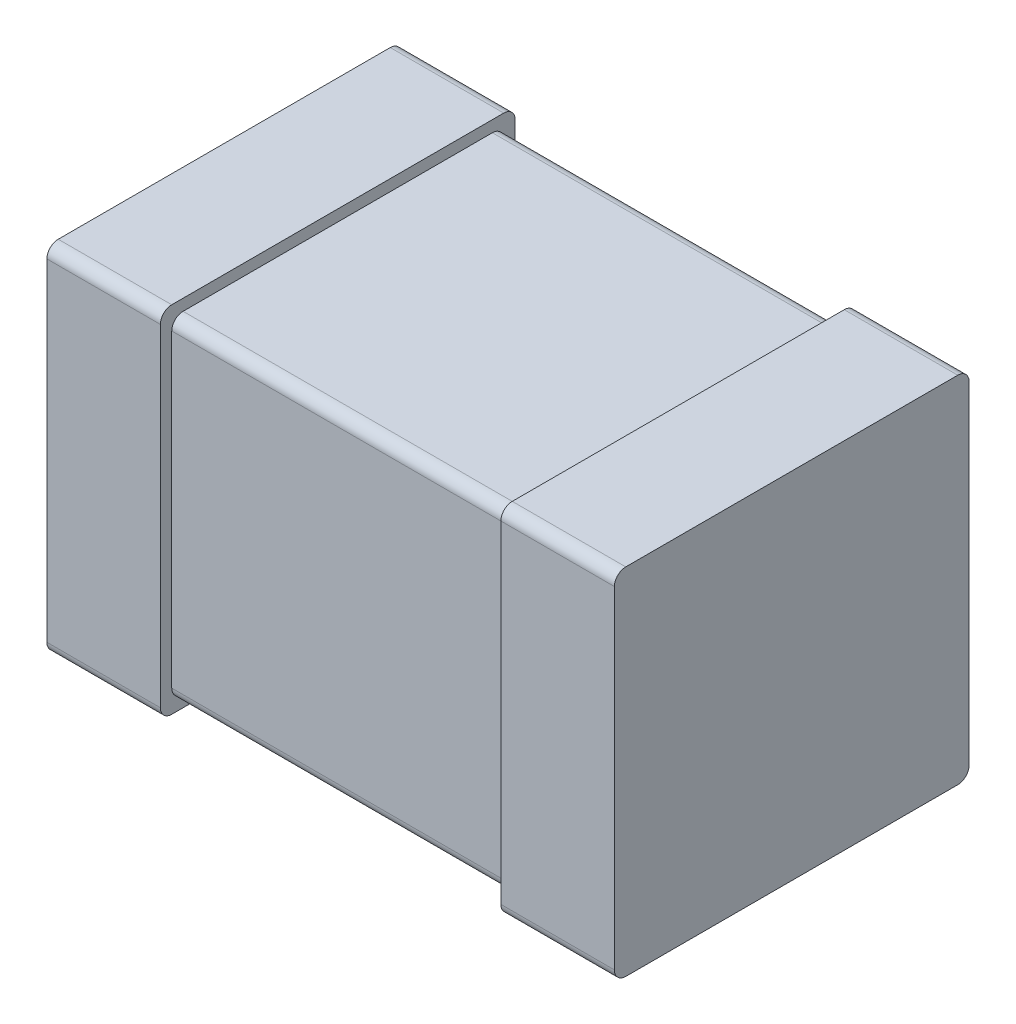
ISO-10303-21;
HEADER;
FILE_DESCRIPTION(('STEP AP214'),'2;1');
FILE_NAME('part.step','',(''),(''),'','','');
FILE_SCHEMA(('AUTOMOTIVE_DESIGN { 1 0 10303 214 1 1 1 1 }'));
ENDSEC;
DATA;
#1=APPLICATION_CONTEXT('core data for automotive mechanical design processes');
#2=APPLICATION_PROTOCOL_DEFINITION('international standard','automotive_design',2000,#1);
#3=PRODUCT_CONTEXT('',#1,'mechanical');
#4=PRODUCT('Part','Part','',(#3));
#5=PRODUCT_RELATED_PRODUCT_CATEGORY('part','',(#4));
#6=PRODUCT_DEFINITION_FORMATION('','',#4);
#7=PRODUCT_DEFINITION_CONTEXT('part definition',#1,'design');
#8=PRODUCT_DEFINITION('design','',#6,#7);
#9=PRODUCT_DEFINITION_SHAPE('','',#8);
#10=(LENGTH_UNIT() NAMED_UNIT(*) SI_UNIT(.MILLI.,.METRE.));
#11=(NAMED_UNIT(*) PLANE_ANGLE_UNIT() SI_UNIT($,.RADIAN.));
#12=(NAMED_UNIT(*) SI_UNIT($,.STERADIAN.) SOLID_ANGLE_UNIT());
#13=UNCERTAINTY_MEASURE_WITH_UNIT(LENGTH_MEASURE(1.E-05),#10,'distance_accuracy_value','');
#14=(GEOMETRIC_REPRESENTATION_CONTEXT(3) GLOBAL_UNCERTAINTY_ASSIGNED_CONTEXT((#13)) GLOBAL_UNIT_ASSIGNED_CONTEXT((#10,
#11,#12)) REPRESENTATION_CONTEXT('',''));
#15=CARTESIAN_POINT('',(0.,0.,0.));
#16=DIRECTION('',(0.,0.,1.));
#17=DIRECTION('',(1.,0.,0.));
#18=AXIS2_PLACEMENT_3D('',#15,#16,#17);
#19=CARTESIAN_POINT('',(-1.,-0.625,0.));
#20=DIRECTION('',(1.,0.,0.));
#21=DIRECTION('',(0.,1.,0.));
#22=AXIS2_PLACEMENT_3D('',#19,#20,#21);
#23=PLANE('',#22);
#24=CARTESIAN_POINT('',(-1.,-0.585,1.21));
#25=DIRECTION('',(-1.,0.,0.));
#26=DIRECTION('',(0.,0.,1.));
#27=AXIS2_PLACEMENT_3D('',#24,#25,#26);
#28=CIRCLE('',#27,0.04);
#29=CARTESIAN_POINT('',(-1.,-0.625,1.21));
#30=VERTEX_POINT('',#29);
#31=CARTESIAN_POINT('',(-1.,-0.585,1.25));
#32=VERTEX_POINT('',#31);
#33=EDGE_CURVE('E11',#30,#32,#28,.T.);
#34=ORIENTED_EDGE('',*,*,#33,.T.);
#35=DIRECTION('',(0.,1.,0.));
#36=VECTOR('',#35,1.);
#37=CARTESIAN_POINT('',(-1.,-0.625,1.25));
#38=LINE('',#37,#36);
#39=CARTESIAN_POINT('',(-1.,0.585,1.25));
#40=VERTEX_POINT('',#39);
#41=EDGE_CURVE('E27',#32,#40,#38,.T.);
#42=ORIENTED_EDGE('',*,*,#41,.T.);
#43=CARTESIAN_POINT('',(-1.,0.585,1.21));
#44=DIRECTION('',(1.,0.,0.));
#45=DIRECTION('',(0.,0.,1.));
#46=AXIS2_PLACEMENT_3D('',#43,#44,#45);
#47=CIRCLE('',#46,0.04);
#48=CARTESIAN_POINT('',(-1.,0.625,1.21));
#49=VERTEX_POINT('',#48);
#50=EDGE_CURVE('E282',#49,#40,#47,.T.);
#51=ORIENTED_EDGE('',*,*,#50,.F.);
#52=DIRECTION('',(0.,0.,1.));
#53=VECTOR('',#52,1.);
#54=CARTESIAN_POINT('',(-1.,0.625,0.));
#55=LINE('',#54,#53);
#56=CARTESIAN_POINT('',(-1.,0.625,0.04));
#57=VERTEX_POINT('',#56);
#58=EDGE_CURVE('E271',#57,#49,#55,.T.);
#59=ORIENTED_EDGE('',*,*,#58,.F.);
#60=CARTESIAN_POINT('',(-1.,0.585,0.04));
#61=DIRECTION('',(-1.,0.,0.));
#62=DIRECTION('',(0.,0.,1.));
#63=AXIS2_PLACEMENT_3D('',#60,#61,#62);
#64=CIRCLE('',#63,0.04);
#65=CARTESIAN_POINT('',(-1.,0.585,0.));
#66=VERTEX_POINT('',#65);
#67=EDGE_CURVE('E312',#57,#66,#64,.T.);
#68=ORIENTED_EDGE('',*,*,#67,.T.);
#69=DIRECTION('',(0.,1.,0.));
#70=VECTOR('',#69,1.);
#71=CARTESIAN_POINT('',(-1.,-0.625,0.));
#72=LINE('',#71,#70);
#73=CARTESIAN_POINT('',(-1.,-0.585,0.));
#74=VERTEX_POINT('',#73);
#75=EDGE_CURVE('E391',#74,#66,#72,.T.);
#76=ORIENTED_EDGE('',*,*,#75,.F.);
#77=CARTESIAN_POINT('',(-1.,-0.585,0.04));
#78=DIRECTION('',(1.,0.,0.));
#79=DIRECTION('',(0.,0.,1.));
#80=AXIS2_PLACEMENT_3D('',#77,#78,#79);
#81=CIRCLE('',#80,0.04);
#82=CARTESIAN_POINT('',(-1.,-0.625,0.04));
#83=VERTEX_POINT('',#82);
#84=EDGE_CURVE('E303',#83,#74,#81,.T.);
#85=ORIENTED_EDGE('',*,*,#84,.F.);
#86=DIRECTION('',(0.,0.,1.));
#87=VECTOR('',#86,1.);
#88=CARTESIAN_POINT('',(-1.,-0.625,0.));
#89=LINE('',#88,#87);
#90=EDGE_CURVE('E316',#83,#30,#89,.T.);
#91=ORIENTED_EDGE('',*,*,#90,.T.);
#92=EDGE_LOOP('',(#34,#42,#51,#59,#68,#76,#85,#91));
#93=FACE_BOUND('',#92,.T.);
#94=ADVANCED_FACE('F16',(#93),#23,.F.);
#95=CARTESIAN_POINT('',(-1.,-0.625,0.));
#96=DIRECTION('',(0.,1.,0.));
#97=DIRECTION('',(1.,0.,0.));
#98=AXIS2_PLACEMENT_3D('',#95,#96,#97);
#99=PLANE('',#98);
#100=DIRECTION('',(1.,0.,0.));
#101=VECTOR('',#100,1.);
#102=CARTESIAN_POINT('',(-1.,-0.625,1.21));
#103=LINE('',#102,#101);
#104=CARTESIAN_POINT('',(-0.6,-0.625,1.21));
#105=VERTEX_POINT('',#104);
#106=EDGE_CURVE('E447',#30,#105,#103,.T.);
#107=ORIENTED_EDGE('',*,*,#106,.F.);
#108=ORIENTED_EDGE('',*,*,#90,.F.);
#109=DIRECTION('',(1.,0.,0.));
#110=VECTOR('',#109,1.);
#111=CARTESIAN_POINT('',(-1.,-0.625,0.04));
#112=LINE('',#111,#110);
#113=CARTESIAN_POINT('',(-0.6,-0.625,0.04));
#114=VERTEX_POINT('',#113);
#115=EDGE_CURVE('E398',#83,#114,#112,.T.);
#116=ORIENTED_EDGE('',*,*,#115,.T.);
#117=DIRECTION('',(0.,0.,1.));
#118=VECTOR('',#117,1.);
#119=CARTESIAN_POINT('',(-0.6,-0.625,0.));
#120=LINE('',#119,#118);
#121=EDGE_CURVE('E307',#114,#105,#120,.T.);
#122=ORIENTED_EDGE('',*,*,#121,.T.);
#123=EDGE_LOOP('',(#107,#108,#116,#122));
#124=FACE_BOUND('',#123,.T.);
#125=ADVANCED_FACE('F491',(#124),#99,.F.);
#126=CARTESIAN_POINT('',(-1.,-0.585,0.04));
#127=DIRECTION('',(1.,0.,0.));
#128=DIRECTION('',(0.,-1.,0.));
#129=AXIS2_PLACEMENT_3D('',#126,#127,#128);
#130=CYLINDRICAL_SURFACE('',#129,0.04);
#131=ORIENTED_EDGE('',*,*,#84,.T.);
#132=DIRECTION('',(1.,0.,0.));
#133=VECTOR('',#132,1.);
#134=CARTESIAN_POINT('',(-1.,-0.585,0.));
#135=LINE('',#134,#133);
#136=CARTESIAN_POINT('',(-0.6,-0.585,0.));
#137=VERTEX_POINT('',#136);
#138=EDGE_CURVE('E308',#74,#137,#135,.T.);
#139=ORIENTED_EDGE('',*,*,#138,.T.);
#140=CARTESIAN_POINT('',(-0.6,-0.585,0.04));
#141=DIRECTION('',(1.,0.,0.));
#142=DIRECTION('',(0.,0.,1.));
#143=AXIS2_PLACEMENT_3D('',#140,#141,#142);
#144=CIRCLE('',#143,0.04);
#145=EDGE_CURVE('E272',#114,#137,#144,.T.);
#146=ORIENTED_EDGE('',*,*,#145,.F.);
#147=ORIENTED_EDGE('',*,*,#115,.F.);
#148=EDGE_LOOP('',(#131,#139,#146,#147));
#149=FACE_BOUND('',#148,.T.);
#150=ADVANCED_FACE('F604',(#149),#130,.T.);
#151=CARTESIAN_POINT('',(-1.,-0.585,1.21));
#152=DIRECTION('',(1.,0.,0.));
#153=DIRECTION('',(0.,-1.,0.));
#154=AXIS2_PLACEMENT_3D('',#151,#152,#153);
#155=CYLINDRICAL_SURFACE('',#154,0.04);
#156=ORIENTED_EDGE('',*,*,#106,.T.);
#157=CARTESIAN_POINT('',(-0.6,-0.585,1.21));
#158=DIRECTION('',(-1.,0.,0.));
#159=DIRECTION('',(0.,0.,1.));
#160=AXIS2_PLACEMENT_3D('',#157,#158,#159);
#161=CIRCLE('',#160,0.04);
#162=CARTESIAN_POINT('',(-0.6,-0.585,1.25));
#163=VERTEX_POINT('',#162);
#164=EDGE_CURVE('E406',#105,#163,#161,.T.);
#165=ORIENTED_EDGE('',*,*,#164,.T.);
#166=DIRECTION('',(1.,0.,0.));
#167=VECTOR('',#166,1.);
#168=CARTESIAN_POINT('',(-1.,-0.585,1.25));
#169=LINE('',#168,#167);
#170=EDGE_CURVE('E345',#32,#163,#169,.T.);
#171=ORIENTED_EDGE('',*,*,#170,.F.);
#172=ORIENTED_EDGE('',*,*,#33,.F.);
#173=EDGE_LOOP('',(#156,#165,#171,#172));
#174=FACE_BOUND('',#173,.T.);
#175=ADVANCED_FACE('F489',(#174),#155,.T.);
#176=CARTESIAN_POINT('',(-1.,-0.625,0.));
#177=DIRECTION('',(0.,0.,1.));
#178=DIRECTION('',(1.,0.,0.));
#179=AXIS2_PLACEMENT_3D('',#176,#177,#178);
#180=PLANE('',#179);
#181=DIRECTION('',(1.,0.,0.));
#182=VECTOR('',#181,1.);
#183=CARTESIAN_POINT('',(-1.,0.585,0.));
#184=LINE('',#183,#182);
#185=CARTESIAN_POINT('',(-0.6,0.585,0.));
#186=VERTEX_POINT('',#185);
#187=EDGE_CURVE('E402',#66,#186,#184,.T.);
#188=ORIENTED_EDGE('',*,*,#187,.T.);
#189=DIRECTION('',(0.,1.,0.));
#190=VECTOR('',#189,1.);
#191=CARTESIAN_POINT('',(-0.6,-0.625,0.));
#192=LINE('',#191,#190);
#193=EDGE_CURVE('E334',#137,#186,#192,.T.);
#194=ORIENTED_EDGE('',*,*,#193,.F.);
#195=ORIENTED_EDGE('',*,*,#138,.F.);
#196=ORIENTED_EDGE('',*,*,#75,.T.);
#197=EDGE_LOOP('',(#188,#194,#195,#196));
#198=FACE_BOUND('',#197,.T.);
#199=ADVANCED_FACE('F603',(#198),#180,.F.);
#200=CARTESIAN_POINT('',(-1.,-0.625,1.25));
#201=DIRECTION('',(0.,0.,1.));
#202=DIRECTION('',(1.,0.,0.));
#203=AXIS2_PLACEMENT_3D('',#200,#201,#202);
#204=PLANE('',#203);
#205=ORIENTED_EDGE('',*,*,#41,.F.);
#206=ORIENTED_EDGE('',*,*,#170,.T.);
#207=DIRECTION('',(0.,1.,0.));
#208=VECTOR('',#207,1.);
#209=CARTESIAN_POINT('',(-0.6,-0.625,1.25));
#210=LINE('',#209,#208);
#211=CARTESIAN_POINT('',(-0.6,0.585,1.25));
#212=VERTEX_POINT('',#211);
#213=EDGE_CURVE('E341',#163,#212,#210,.T.);
#214=ORIENTED_EDGE('',*,*,#213,.T.);
#215=DIRECTION('',(1.,0.,0.));
#216=VECTOR('',#215,1.);
#217=CARTESIAN_POINT('',(-1.,0.585,1.25));
#218=LINE('',#217,#216);
#219=EDGE_CURVE('E397',#40,#212,#218,.T.);
#220=ORIENTED_EDGE('',*,*,#219,.F.);
#221=EDGE_LOOP('',(#205,#206,#214,#220));
#222=FACE_BOUND('',#221,.T.);
#223=ADVANCED_FACE('F629',(#222),#204,.T.);
#224=CARTESIAN_POINT('',(-1.,0.585,0.04));
#225=DIRECTION('',(1.,0.,0.));
#226=DIRECTION('',(0.,1.,0.));
#227=AXIS2_PLACEMENT_3D('',#224,#225,#226);
#228=CYLINDRICAL_SURFACE('',#227,0.04);
#229=DIRECTION('',(1.,0.,0.));
#230=VECTOR('',#229,1.);
#231=CARTESIAN_POINT('',(-1.,0.625,0.04));
#232=LINE('',#231,#230);
#233=CARTESIAN_POINT('',(-0.6,0.625,0.04));
#234=VERTEX_POINT('',#233);
#235=EDGE_CURVE('E281',#57,#234,#232,.T.);
#236=ORIENTED_EDGE('',*,*,#235,.T.);
#237=CARTESIAN_POINT('',(-0.6,0.585,0.04));
#238=DIRECTION('',(-1.,0.,0.));
#239=DIRECTION('',(0.,0.,1.));
#240=AXIS2_PLACEMENT_3D('',#237,#238,#239);
#241=CIRCLE('',#240,0.04);
#242=EDGE_CURVE('E278',#234,#186,#241,.T.);
#243=ORIENTED_EDGE('',*,*,#242,.T.);
#244=ORIENTED_EDGE('',*,*,#187,.F.);
#245=ORIENTED_EDGE('',*,*,#67,.F.);
#246=EDGE_LOOP('',(#236,#243,#244,#245));
#247=FACE_BOUND('',#246,.T.);
#248=ADVANCED_FACE('F593',(#247),#228,.T.);
#249=CARTESIAN_POINT('',(-1.,0.585,1.21));
#250=DIRECTION('',(1.,0.,0.));
#251=DIRECTION('',(0.,1.,0.));
#252=AXIS2_PLACEMENT_3D('',#249,#250,#251);
#253=CYLINDRICAL_SURFACE('',#252,0.04);
#254=ORIENTED_EDGE('',*,*,#50,.T.);
#255=ORIENTED_EDGE('',*,*,#219,.T.);
#256=CARTESIAN_POINT('',(-0.6,0.585,1.21));
#257=DIRECTION('',(1.,0.,0.));
#258=DIRECTION('',(0.,0.,1.));
#259=AXIS2_PLACEMENT_3D('',#256,#257,#258);
#260=CIRCLE('',#259,0.04);
#261=CARTESIAN_POINT('',(-0.6,0.625,1.21));
#262=VERTEX_POINT('',#261);
#263=EDGE_CURVE('E350',#262,#212,#260,.T.);
#264=ORIENTED_EDGE('',*,*,#263,.F.);
#265=DIRECTION('',(1.,0.,0.));
#266=VECTOR('',#265,1.);
#267=CARTESIAN_POINT('',(-1.,0.625,1.21));
#268=LINE('',#267,#266);
#269=EDGE_CURVE('E268',#49,#262,#268,.T.);
#270=ORIENTED_EDGE('',*,*,#269,.F.);
#271=EDGE_LOOP('',(#254,#255,#264,#270));
#272=FACE_BOUND('',#271,.T.);
#273=ADVANCED_FACE('F588',(#272),#253,.T.);
#274=CARTESIAN_POINT('',(-1.,0.625,0.));
#275=DIRECTION('',(0.,1.,0.));
#276=DIRECTION('',(1.,0.,0.));
#277=AXIS2_PLACEMENT_3D('',#274,#275,#276);
#278=PLANE('',#277);
#279=DIRECTION('',(0.,0.,1.));
#280=VECTOR('',#279,1.);
#281=CARTESIAN_POINT('',(-0.6,0.625,0.));
#282=LINE('',#281,#280);
#283=EDGE_CURVE('E346',#234,#262,#282,.T.);
#284=ORIENTED_EDGE('',*,*,#283,.F.);
#285=ORIENTED_EDGE('',*,*,#235,.F.);
#286=ORIENTED_EDGE('',*,*,#58,.T.);
#287=ORIENTED_EDGE('',*,*,#269,.T.);
#288=EDGE_LOOP('',(#284,#285,#286,#287));
#289=FACE_BOUND('',#288,.T.);
#290=ADVANCED_FACE('F592',(#289),#278,.T.);
#291=CARTESIAN_POINT('',(-0.6,-0.625,0.));
#292=DIRECTION('',(1.,0.,0.));
#293=DIRECTION('',(0.,1.,0.));
#294=AXIS2_PLACEMENT_3D('',#291,#292,#293);
#295=PLANE('',#294);
#296=ORIENTED_EDGE('',*,*,#121,.F.);
#297=ORIENTED_EDGE('',*,*,#145,.T.);
#298=ORIENTED_EDGE('',*,*,#193,.T.);
#299=ORIENTED_EDGE('',*,*,#242,.F.);
#300=ORIENTED_EDGE('',*,*,#283,.T.);
#301=ORIENTED_EDGE('',*,*,#263,.T.);
#302=ORIENTED_EDGE('',*,*,#213,.F.);
#303=ORIENTED_EDGE('',*,*,#164,.F.);
#304=EDGE_LOOP('',(#296,#297,#298,#299,#300,#301,#302,#303));
#305=FACE_BOUND('',#304,.T.);
#306=CARTESIAN_POINT('',(-0.6,-0.545,0.08));
#307=DIRECTION('',(1.,0.,0.));
#308=DIRECTION('',(0.,0.,1.));
#309=AXIS2_PLACEMENT_3D('',#306,#307,#308);
#310=CIRCLE('',#309,0.04);
#311=CARTESIAN_POINT('',(-0.6,-0.585,0.08));
#312=VERTEX_POINT('',#311);
#313=CARTESIAN_POINT('',(-0.6,-0.545,0.04));
#314=VERTEX_POINT('',#313);
#315=EDGE_CURVE('E326',#312,#314,#310,.T.);
#316=ORIENTED_EDGE('',*,*,#315,.F.);
#317=DIRECTION('',(0.,0.,1.));
#318=VECTOR('',#317,1.);
#319=CARTESIAN_POINT('',(-0.6,-0.585,0.04));
#320=LINE('',#319,#318);
#321=CARTESIAN_POINT('',(-0.6,-0.585,1.17));
#322=VERTEX_POINT('',#321);
#323=EDGE_CURVE('E288',#312,#322,#320,.T.);
#324=ORIENTED_EDGE('',*,*,#323,.T.);
#325=CARTESIAN_POINT('',(-0.6,-0.545,1.17));
#326=DIRECTION('',(-1.,0.,0.));
#327=DIRECTION('',(0.,0.,1.));
#328=AXIS2_PLACEMENT_3D('',#325,#326,#327);
#329=CIRCLE('',#328,0.04);
#330=CARTESIAN_POINT('',(-0.6,-0.545,1.21));
#331=VERTEX_POINT('',#330);
#332=EDGE_CURVE('E284',#322,#331,#329,.T.);
#333=ORIENTED_EDGE('',*,*,#332,.T.);
#334=DIRECTION('',(0.,1.,0.));
#335=VECTOR('',#334,1.);
#336=CARTESIAN_POINT('',(-0.6,-0.585,1.21));
#337=LINE('',#336,#335);
#338=CARTESIAN_POINT('',(-0.6,0.545,1.21));
#339=VERTEX_POINT('',#338);
#340=EDGE_CURVE('E289',#331,#339,#337,.T.);
#341=ORIENTED_EDGE('',*,*,#340,.T.);
#342=CARTESIAN_POINT('',(-0.6,0.545,1.17));
#343=DIRECTION('',(1.,0.,0.));
#344=DIRECTION('',(0.,0.,1.));
#345=AXIS2_PLACEMENT_3D('',#342,#343,#344);
#346=CIRCLE('',#345,0.04);
#347=CARTESIAN_POINT('',(-0.6,0.585,1.17));
#348=VERTEX_POINT('',#347);
#349=EDGE_CURVE('E321',#348,#339,#346,.T.);
#350=ORIENTED_EDGE('',*,*,#349,.F.);
#351=DIRECTION('',(0.,0.,1.));
#352=VECTOR('',#351,1.);
#353=CARTESIAN_POINT('',(-0.6,0.585,0.04));
#354=LINE('',#353,#352);
#355=CARTESIAN_POINT('',(-0.6,0.585,0.08));
#356=VERTEX_POINT('',#355);
#357=EDGE_CURVE('E320',#356,#348,#354,.T.);
#358=ORIENTED_EDGE('',*,*,#357,.F.);
#359=CARTESIAN_POINT('',(-0.6,0.545,0.08));
#360=DIRECTION('',(-1.,0.,0.));
#361=DIRECTION('',(0.,0.,1.));
#362=AXIS2_PLACEMENT_3D('',#359,#360,#361);
#363=CIRCLE('',#362,0.04);
#364=CARTESIAN_POINT('',(-0.6,0.545,0.04));
#365=VERTEX_POINT('',#364);
#366=EDGE_CURVE('E322',#356,#365,#363,.T.);
#367=ORIENTED_EDGE('',*,*,#366,.T.);
#368=DIRECTION('',(0.,1.,0.));
#369=VECTOR('',#368,1.);
#370=CARTESIAN_POINT('',(-0.6,-0.585,0.04));
#371=LINE('',#370,#369);
#372=EDGE_CURVE('E463',#314,#365,#371,.T.);
#373=ORIENTED_EDGE('',*,*,#372,.F.);
#374=EDGE_LOOP('',(#316,#324,#333,#341,#350,#358,#367,#373));
#375=FACE_BOUND('',#374,.T.);
#376=ADVANCED_FACE('F496',(#305,#375),#295,.T.);
#377=CARTESIAN_POINT('',(-0.6,-0.545,0.08));
#378=DIRECTION('',(1.,0.,0.));
#379=DIRECTION('',(0.,-1.,0.));
#380=AXIS2_PLACEMENT_3D('',#377,#378,#379);
#381=CYLINDRICAL_SURFACE('',#380,0.04);
#382=ORIENTED_EDGE('',*,*,#315,.T.);
#383=DIRECTION('',(1.,0.,0.));
#384=VECTOR('',#383,1.);
#385=CARTESIAN_POINT('',(-0.6,-0.545,0.04));
#386=LINE('',#385,#384);
#387=CARTESIAN_POINT('',(0.6,-0.545,0.04));
#388=VERTEX_POINT('',#387);
#389=EDGE_CURVE('E365',#314,#388,#386,.T.);
#390=ORIENTED_EDGE('',*,*,#389,.T.);
#391=CARTESIAN_POINT('',(0.6,-0.545,0.08));
#392=DIRECTION('',(1.,0.,0.));
#393=DIRECTION('',(0.,0.,1.));
#394=AXIS2_PLACEMENT_3D('',#391,#392,#393);
#395=CIRCLE('',#394,0.04);
#396=CARTESIAN_POINT('',(0.6,-0.585,0.08));
#397=VERTEX_POINT('',#396);
#398=EDGE_CURVE('E422',#397,#388,#395,.T.);
#399=ORIENTED_EDGE('',*,*,#398,.F.);
#400=DIRECTION('',(1.,0.,0.));
#401=VECTOR('',#400,1.);
#402=CARTESIAN_POINT('',(-0.6,-0.585,0.08));
#403=LINE('',#402,#401);
#404=EDGE_CURVE('E331',#312,#397,#403,.T.);
#405=ORIENTED_EDGE('',*,*,#404,.F.);
#406=EDGE_LOOP('',(#382,#390,#399,#405));
#407=FACE_BOUND('',#406,.T.);
#408=ADVANCED_FACE('F522',(#407),#381,.T.);
#409=CARTESIAN_POINT('',(-0.6,-0.585,0.04));
#410=DIRECTION('',(0.,0.,1.));
#411=DIRECTION('',(1.,0.,0.));
#412=AXIS2_PLACEMENT_3D('',#409,#410,#411);
#413=PLANE('',#412);
#414=DIRECTION('',(1.,0.,0.));
#415=VECTOR('',#414,1.);
#416=CARTESIAN_POINT('',(-0.6,0.545,0.04));
#417=LINE('',#416,#415);
#418=CARTESIAN_POINT('',(0.6,0.545,0.04));
#419=VERTEX_POINT('',#418);
#420=EDGE_CURVE('E460',#365,#419,#417,.T.);
#421=ORIENTED_EDGE('',*,*,#420,.T.);
#422=DIRECTION('',(0.,1.,0.));
#423=VECTOR('',#422,1.);
#424=CARTESIAN_POINT('',(0.6,-0.585,0.04));
#425=LINE('',#424,#423);
#426=EDGE_CURVE('E368',#388,#419,#425,.T.);
#427=ORIENTED_EDGE('',*,*,#426,.F.);
#428=ORIENTED_EDGE('',*,*,#389,.F.);
#429=ORIENTED_EDGE('',*,*,#372,.T.);
#430=EDGE_LOOP('',(#421,#427,#428,#429));
#431=FACE_BOUND('',#430,.T.);
#432=ADVANCED_FACE('F512',(#431),#413,.F.);
#433=CARTESIAN_POINT('',(-0.6,0.545,0.08));
#434=DIRECTION('',(1.,0.,0.));
#435=DIRECTION('',(0.,1.,0.));
#436=AXIS2_PLACEMENT_3D('',#433,#434,#435);
#437=CYLINDRICAL_SURFACE('',#436,0.04);
#438=DIRECTION('',(1.,0.,0.));
#439=VECTOR('',#438,1.);
#440=CARTESIAN_POINT('',(-0.6,0.585,0.08));
#441=LINE('',#440,#439);
#442=CARTESIAN_POINT('',(0.6,0.585,0.08));
#443=VERTEX_POINT('',#442);
#444=EDGE_CURVE('E456',#356,#443,#441,.T.);
#445=ORIENTED_EDGE('',*,*,#444,.T.);
#446=CARTESIAN_POINT('',(0.6,0.545,0.08));
#447=DIRECTION('',(-1.,0.,0.));
#448=DIRECTION('',(0.,0.,1.));
#449=AXIS2_PLACEMENT_3D('',#446,#447,#448);
#450=CIRCLE('',#449,0.04);
#451=EDGE_CURVE('E354',#443,#419,#450,.T.);
#452=ORIENTED_EDGE('',*,*,#451,.T.);
#453=ORIENTED_EDGE('',*,*,#420,.F.);
#454=ORIENTED_EDGE('',*,*,#366,.F.);
#455=EDGE_LOOP('',(#445,#452,#453,#454));
#456=FACE_BOUND('',#455,.T.);
#457=ADVANCED_FACE('F518',(#456),#437,.T.);
#458=CARTESIAN_POINT('',(-0.6,0.585,0.04));
#459=DIRECTION('',(0.,1.,0.));
#460=DIRECTION('',(1.,0.,0.));
#461=AXIS2_PLACEMENT_3D('',#458,#459,#460);
#462=PLANE('',#461);
#463=DIRECTION('',(0.,0.,1.));
#464=VECTOR('',#463,1.);
#465=CARTESIAN_POINT('',(0.6,0.585,0.04));
#466=LINE('',#465,#464);
#467=CARTESIAN_POINT('',(0.6,0.585,1.17));
#468=VERTEX_POINT('',#467);
#469=EDGE_CURVE('E213',#443,#468,#466,.T.);
#470=ORIENTED_EDGE('',*,*,#469,.F.);
#471=ORIENTED_EDGE('',*,*,#444,.F.);
#472=ORIENTED_EDGE('',*,*,#357,.T.);
#473=DIRECTION('',(1.,0.,0.));
#474=VECTOR('',#473,1.);
#475=CARTESIAN_POINT('',(-0.6,0.585,1.17));
#476=LINE('',#475,#474);
#477=EDGE_CURVE('E317',#348,#468,#476,.T.);
#478=ORIENTED_EDGE('',*,*,#477,.T.);
#479=EDGE_LOOP('',(#470,#471,#472,#478));
#480=FACE_BOUND('',#479,.T.);
#481=ADVANCED_FACE('F572',(#480),#462,.T.);
#482=CARTESIAN_POINT('',(-0.6,0.545,1.17));
#483=DIRECTION('',(1.,0.,0.));
#484=DIRECTION('',(0.,1.,0.));
#485=AXIS2_PLACEMENT_3D('',#482,#483,#484);
#486=CYLINDRICAL_SURFACE('',#485,0.04);
#487=ORIENTED_EDGE('',*,*,#349,.T.);
#488=DIRECTION('',(1.,0.,0.));
#489=VECTOR('',#488,1.);
#490=CARTESIAN_POINT('',(-0.6,0.545,1.21));
#491=LINE('',#490,#489);
#492=CARTESIAN_POINT('',(0.6,0.545,1.21));
#493=VERTEX_POINT('',#492);
#494=EDGE_CURVE('E20',#339,#493,#491,.T.);
#495=ORIENTED_EDGE('',*,*,#494,.T.);
#496=CARTESIAN_POINT('',(0.6,0.545,1.17));
#497=DIRECTION('',(1.,0.,0.));
#498=DIRECTION('',(0.,0.,1.));
#499=AXIS2_PLACEMENT_3D('',#496,#497,#498);
#500=CIRCLE('',#499,0.04);
#501=EDGE_CURVE('E222',#468,#493,#500,.T.);
#502=ORIENTED_EDGE('',*,*,#501,.F.);
#503=ORIENTED_EDGE('',*,*,#477,.F.);
#504=EDGE_LOOP('',(#487,#495,#502,#503));
#505=FACE_BOUND('',#504,.T.);
#506=ADVANCED_FACE('F568',(#505),#486,.T.);
#507=CARTESIAN_POINT('',(-0.6,-0.585,1.21));
#508=DIRECTION('',(0.,0.,1.));
#509=DIRECTION('',(1.,0.,0.));
#510=AXIS2_PLACEMENT_3D('',#507,#508,#509);
#511=PLANE('',#510);
#512=ORIENTED_EDGE('',*,*,#340,.F.);
#513=DIRECTION('',(1.,0.,0.));
#514=VECTOR('',#513,1.);
#515=CARTESIAN_POINT('',(-0.6,-0.545,1.21));
#516=LINE('',#515,#514);
#517=CARTESIAN_POINT('',(0.6,-0.545,1.21));
#518=VERTEX_POINT('',#517);
#519=EDGE_CURVE('E339',#331,#518,#516,.T.);
#520=ORIENTED_EDGE('',*,*,#519,.T.);
#521=DIRECTION('',(0.,1.,0.));
#522=VECTOR('',#521,1.);
#523=CARTESIAN_POINT('',(0.6,-0.585,1.21));
#524=LINE('',#523,#522);
#525=EDGE_CURVE('E335',#518,#493,#524,.T.);
#526=ORIENTED_EDGE('',*,*,#525,.T.);
#527=ORIENTED_EDGE('',*,*,#494,.F.);
#528=EDGE_LOOP('',(#512,#520,#526,#527));
#529=FACE_BOUND('',#528,.T.);
#530=ADVANCED_FACE('F536',(#529),#511,.T.);
#531=CARTESIAN_POINT('',(-0.6,-0.545,1.17));
#532=DIRECTION('',(1.,0.,0.));
#533=DIRECTION('',(0.,-1.,0.));
#534=AXIS2_PLACEMENT_3D('',#531,#532,#533);
#535=CYLINDRICAL_SURFACE('',#534,0.04);
#536=DIRECTION('',(1.,0.,0.));
#537=VECTOR('',#536,1.);
#538=CARTESIAN_POINT('',(-0.6,-0.585,1.17));
#539=LINE('',#538,#537);
#540=CARTESIAN_POINT('',(0.6,-0.585,1.17));
#541=VERTEX_POINT('',#540);
#542=EDGE_CURVE('E340',#322,#541,#539,.T.);
#543=ORIENTED_EDGE('',*,*,#542,.T.);
#544=CARTESIAN_POINT('',(0.6,-0.545,1.17));
#545=DIRECTION('',(-1.,0.,0.));
#546=DIRECTION('',(0.,0.,1.));
#547=AXIS2_PLACEMENT_3D('',#544,#545,#546);
#548=CIRCLE('',#547,0.04);
#549=EDGE_CURVE('E358',#541,#518,#548,.T.);
#550=ORIENTED_EDGE('',*,*,#549,.T.);
#551=ORIENTED_EDGE('',*,*,#519,.F.);
#552=ORIENTED_EDGE('',*,*,#332,.F.);
#553=EDGE_LOOP('',(#543,#550,#551,#552));
#554=FACE_BOUND('',#553,.T.);
#555=ADVANCED_FACE('F528',(#554),#535,.T.);
#556=CARTESIAN_POINT('',(-0.6,-0.585,0.04));
#557=DIRECTION('',(0.,1.,0.));
#558=DIRECTION('',(1.,0.,0.));
#559=AXIS2_PLACEMENT_3D('',#556,#557,#558);
#560=PLANE('',#559);
#561=ORIENTED_EDGE('',*,*,#542,.F.);
#562=ORIENTED_EDGE('',*,*,#323,.F.);
#563=ORIENTED_EDGE('',*,*,#404,.T.);
#564=DIRECTION('',(0.,0.,1.));
#565=VECTOR('',#564,1.);
#566=CARTESIAN_POINT('',(0.6,-0.585,0.04));
#567=LINE('',#566,#565);
#568=EDGE_CURVE('E327',#397,#541,#567,.T.);
#569=ORIENTED_EDGE('',*,*,#568,.T.);
#570=EDGE_LOOP('',(#561,#562,#563,#569));
#571=FACE_BOUND('',#570,.T.);
#572=ADVANCED_FACE('F526',(#571),#560,.F.);
#573=CARTESIAN_POINT('',(0.6,-0.625,0.));
#574=DIRECTION('',(1.,0.,0.));
#575=DIRECTION('',(0.,1.,0.));
#576=AXIS2_PLACEMENT_3D('',#573,#574,#575);
#577=PLANE('',#576);
#578=CARTESIAN_POINT('',(0.6,-0.585,1.21));
#579=DIRECTION('',(-1.,0.,0.));
#580=DIRECTION('',(0.,0.,1.));
#581=AXIS2_PLACEMENT_3D('',#578,#579,#580);
#582=CIRCLE('',#581,0.04);
#583=CARTESIAN_POINT('',(0.6,-0.625,1.21));
#584=VERTEX_POINT('',#583);
#585=CARTESIAN_POINT('',(0.6,-0.585,1.25));
#586=VERTEX_POINT('',#585);
#587=EDGE_CURVE('E246',#584,#586,#582,.T.);
#588=ORIENTED_EDGE('',*,*,#587,.T.);
#589=DIRECTION('',(0.,1.,0.));
#590=VECTOR('',#589,1.);
#591=CARTESIAN_POINT('',(0.6,-0.625,1.25));
#592=LINE('',#591,#590);
#593=CARTESIAN_POINT('',(0.6,0.585,1.25));
#594=VERTEX_POINT('',#593);
#595=EDGE_CURVE('E243',#586,#594,#592,.T.);
#596=ORIENTED_EDGE('',*,*,#595,.T.);
#597=CARTESIAN_POINT('',(0.6,0.585,1.21));
#598=DIRECTION('',(1.,0.,0.));
#599=DIRECTION('',(0.,0.,1.));
#600=AXIS2_PLACEMENT_3D('',#597,#598,#599);
#601=CIRCLE('',#600,0.04);
#602=CARTESIAN_POINT('',(0.6,0.625,1.21));
#603=VERTEX_POINT('',#602);
#604=EDGE_CURVE('E231',#603,#594,#601,.T.);
#605=ORIENTED_EDGE('',*,*,#604,.F.);
#606=DIRECTION('',(0.,0.,1.));
#607=VECTOR('',#606,1.);
#608=CARTESIAN_POINT('',(0.6,0.625,0.));
#609=LINE('',#608,#607);
#610=CARTESIAN_POINT('',(0.6,0.625,0.04));
#611=VERTEX_POINT('',#610);
#612=EDGE_CURVE('E257',#611,#603,#609,.T.);
#613=ORIENTED_EDGE('',*,*,#612,.F.);
#614=CARTESIAN_POINT('',(0.6,0.585,0.04));
#615=DIRECTION('',(-1.,0.,0.));
#616=DIRECTION('',(0.,0.,1.));
#617=AXIS2_PLACEMENT_3D('',#614,#615,#616);
#618=CIRCLE('',#617,0.04);
#619=CARTESIAN_POINT('',(0.6,0.585,0.));
#620=VERTEX_POINT('',#619);
#621=EDGE_CURVE('E250',#611,#620,#618,.T.);
#622=ORIENTED_EDGE('',*,*,#621,.T.);
#623=DIRECTION('',(0.,1.,0.));
#624=VECTOR('',#623,1.);
#625=CARTESIAN_POINT('',(0.6,-0.625,0.));
#626=LINE('',#625,#624);
#627=CARTESIAN_POINT('',(0.6,-0.585,0.));
#628=VERTEX_POINT('',#627);
#629=EDGE_CURVE('E415',#628,#620,#626,.T.);
#630=ORIENTED_EDGE('',*,*,#629,.F.);
#631=CARTESIAN_POINT('',(0.6,-0.585,0.04));
#632=DIRECTION('',(1.,0.,0.));
#633=DIRECTION('',(0.,0.,1.));
#634=AXIS2_PLACEMENT_3D('',#631,#632,#633);
#635=CIRCLE('',#634,0.04);
#636=CARTESIAN_POINT('',(0.6,-0.625,0.04));
#637=VERTEX_POINT('',#636);
#638=EDGE_CURVE('E377',#637,#628,#635,.T.);
#639=ORIENTED_EDGE('',*,*,#638,.F.);
#640=DIRECTION('',(0.,0.,1.));
#641=VECTOR('',#640,1.);
#642=CARTESIAN_POINT('',(0.6,-0.625,0.));
#643=LINE('',#642,#641);
#644=EDGE_CURVE('E372',#637,#584,#643,.T.);
#645=ORIENTED_EDGE('',*,*,#644,.T.);
#646=EDGE_LOOP('',(#588,#596,#605,#613,#622,#630,#639,#645));
#647=FACE_BOUND('',#646,.T.);
#648=ORIENTED_EDGE('',*,*,#426,.T.);
#649=ORIENTED_EDGE('',*,*,#451,.F.);
#650=ORIENTED_EDGE('',*,*,#469,.T.);
#651=ORIENTED_EDGE('',*,*,#501,.T.);
#652=ORIENTED_EDGE('',*,*,#525,.F.);
#653=ORIENTED_EDGE('',*,*,#549,.F.);
#654=ORIENTED_EDGE('',*,*,#568,.F.);
#655=ORIENTED_EDGE('',*,*,#398,.T.);
#656=EDGE_LOOP('',(#648,#649,#650,#651,#652,#653,#654,#655));
#657=FACE_BOUND('',#656,.T.);
#658=ADVANCED_FACE('F244',(#647,#657),#577,.F.);
#659=CARTESIAN_POINT('',(0.6,-0.625,0.));
#660=DIRECTION('',(0.,1.,0.));
#661=DIRECTION('',(1.,0.,0.));
#662=AXIS2_PLACEMENT_3D('',#659,#660,#661);
#663=PLANE('',#662);
#664=DIRECTION('',(1.,0.,0.));
#665=VECTOR('',#664,1.);
#666=CARTESIAN_POINT('',(0.6,-0.625,1.21));
#667=LINE('',#666,#665);
#668=CARTESIAN_POINT('',(1.,-0.625,1.21));
#669=VERTEX_POINT('',#668);
#670=EDGE_CURVE('E273',#584,#669,#667,.T.);
#671=ORIENTED_EDGE('',*,*,#670,.F.);
#672=ORIENTED_EDGE('',*,*,#644,.F.);
#673=DIRECTION('',(1.,0.,0.));
#674=VECTOR('',#673,1.);
#675=CARTESIAN_POINT('',(0.6,-0.625,0.04));
#676=LINE('',#675,#674);
#677=CARTESIAN_POINT('',(1.,-0.625,0.04));
#678=VERTEX_POINT('',#677);
#679=EDGE_CURVE('E376',#637,#678,#676,.T.);
#680=ORIENTED_EDGE('',*,*,#679,.T.);
#681=DIRECTION('',(0.,0.,1.));
#682=VECTOR('',#681,1.);
#683=CARTESIAN_POINT('',(1.,-0.625,0.));
#684=LINE('',#683,#682);
#685=EDGE_CURVE('E373',#678,#669,#684,.T.);
#686=ORIENTED_EDGE('',*,*,#685,.T.);
#687=EDGE_LOOP('',(#671,#672,#680,#686));
#688=FACE_BOUND('',#687,.T.);
#689=ADVANCED_FACE('F549',(#688),#663,.F.);
#690=CARTESIAN_POINT('',(0.6,-0.585,0.04));
#691=DIRECTION('',(1.,0.,0.));
#692=DIRECTION('',(0.,-1.,0.));
#693=AXIS2_PLACEMENT_3D('',#690,#691,#692);
#694=CYLINDRICAL_SURFACE('',#693,0.04);
#695=ORIENTED_EDGE('',*,*,#638,.T.);
#696=DIRECTION('',(1.,0.,0.));
#697=VECTOR('',#696,1.);
#698=CARTESIAN_POINT('',(0.6,-0.585,0.));
#699=LINE('',#698,#697);
#700=CARTESIAN_POINT('',(1.,-0.585,0.));
#701=VERTEX_POINT('',#700);
#702=EDGE_CURVE('E276',#628,#701,#699,.T.);
#703=ORIENTED_EDGE('',*,*,#702,.T.);
#704=CARTESIAN_POINT('',(1.,-0.585,0.04));
#705=DIRECTION('',(1.,0.,0.));
#706=DIRECTION('',(0.,0.,1.));
#707=AXIS2_PLACEMENT_3D('',#704,#705,#706);
#708=CIRCLE('',#707,0.04);
#709=EDGE_CURVE('E290',#678,#701,#708,.T.);
#710=ORIENTED_EDGE('',*,*,#709,.F.);
#711=ORIENTED_EDGE('',*,*,#679,.F.);
#712=EDGE_LOOP('',(#695,#703,#710,#711));
#713=FACE_BOUND('',#712,.T.);
#714=ADVANCED_FACE('F542',(#713),#694,.T.);
#715=CARTESIAN_POINT('',(0.6,-0.585,1.21));
#716=DIRECTION('',(1.,0.,0.));
#717=DIRECTION('',(0.,-1.,0.));
#718=AXIS2_PLACEMENT_3D('',#715,#716,#717);
#719=CYLINDRICAL_SURFACE('',#718,0.04);
#720=ORIENTED_EDGE('',*,*,#670,.T.);
#721=CARTESIAN_POINT('',(1.,-0.585,1.21));
#722=DIRECTION('',(-1.,0.,0.));
#723=DIRECTION('',(0.,0.,1.));
#724=AXIS2_PLACEMENT_3D('',#721,#722,#723);
#725=CIRCLE('',#724,0.04);
#726=CARTESIAN_POINT('',(1.,-0.585,1.25));
#727=VERTEX_POINT('',#726);
#728=EDGE_CURVE('E277',#669,#727,#725,.T.);
#729=ORIENTED_EDGE('',*,*,#728,.T.);
#730=DIRECTION('',(1.,0.,0.));
#731=VECTOR('',#730,1.);
#732=CARTESIAN_POINT('',(0.6,-0.585,1.25));
#733=LINE('',#732,#731);
#734=EDGE_CURVE('E311',#586,#727,#733,.T.);
#735=ORIENTED_EDGE('',*,*,#734,.F.);
#736=ORIENTED_EDGE('',*,*,#587,.F.);
#737=EDGE_LOOP('',(#720,#729,#735,#736));
#738=FACE_BOUND('',#737,.T.);
#739=ADVANCED_FACE('F548',(#738),#719,.T.);
#740=CARTESIAN_POINT('',(0.6,-0.625,0.));
#741=DIRECTION('',(0.,0.,1.));
#742=DIRECTION('',(1.,0.,0.));
#743=AXIS2_PLACEMENT_3D('',#740,#741,#742);
#744=PLANE('',#743);
#745=DIRECTION('',(1.,0.,0.));
#746=VECTOR('',#745,1.);
#747=CARTESIAN_POINT('',(0.6,0.585,0.));
#748=LINE('',#747,#746);
#749=CARTESIAN_POINT('',(1.,0.585,0.));
#750=VERTEX_POINT('',#749);
#751=EDGE_CURVE('E297',#620,#750,#748,.T.);
#752=ORIENTED_EDGE('',*,*,#751,.T.);
#753=DIRECTION('',(0.,1.,0.));
#754=VECTOR('',#753,1.);
#755=CARTESIAN_POINT('',(1.,-0.625,0.));
#756=LINE('',#755,#754);
#757=EDGE_CURVE('E293',#701,#750,#756,.T.);
#758=ORIENTED_EDGE('',*,*,#757,.F.);
#759=ORIENTED_EDGE('',*,*,#702,.F.);
#760=ORIENTED_EDGE('',*,*,#629,.T.);
#761=EDGE_LOOP('',(#752,#758,#759,#760));
#762=FACE_BOUND('',#761,.T.);
#763=ADVANCED_FACE('F562',(#762),#744,.F.);
#764=CARTESIAN_POINT('',(0.6,-0.625,1.25));
#765=DIRECTION('',(0.,0.,1.));
#766=DIRECTION('',(1.,0.,0.));
#767=AXIS2_PLACEMENT_3D('',#764,#765,#766);
#768=PLANE('',#767);
#769=ORIENTED_EDGE('',*,*,#595,.F.);
#770=ORIENTED_EDGE('',*,*,#734,.T.);
#771=DIRECTION('',(0.,1.,0.));
#772=VECTOR('',#771,1.);
#773=CARTESIAN_POINT('',(1.,-0.625,1.25));
#774=LINE('',#773,#772);
#775=CARTESIAN_POINT('',(1.,0.585,1.25));
#776=VERTEX_POINT('',#775);
#777=EDGE_CURVE('E254',#727,#776,#774,.T.);
#778=ORIENTED_EDGE('',*,*,#777,.T.);
#779=DIRECTION('',(1.,0.,0.));
#780=VECTOR('',#779,1.);
#781=CARTESIAN_POINT('',(0.6,0.585,1.25));
#782=LINE('',#781,#780);
#783=EDGE_CURVE('E234',#594,#776,#782,.T.);
#784=ORIENTED_EDGE('',*,*,#783,.F.);
#785=EDGE_LOOP('',(#769,#770,#778,#784));
#786=FACE_BOUND('',#785,.T.);
#787=ADVANCED_FACE('F252',(#786),#768,.T.);
#788=CARTESIAN_POINT('',(0.6,0.585,0.04));
#789=DIRECTION('',(1.,0.,0.));
#790=DIRECTION('',(0.,1.,0.));
#791=AXIS2_PLACEMENT_3D('',#788,#789,#790);
#792=CYLINDRICAL_SURFACE('',#791,0.04);
#793=DIRECTION('',(1.,0.,0.));
#794=VECTOR('',#793,1.);
#795=CARTESIAN_POINT('',(0.6,0.625,0.04));
#796=LINE('',#795,#794);
#797=CARTESIAN_POINT('',(1.,0.625,0.04));
#798=VERTEX_POINT('',#797);
#799=EDGE_CURVE('E266',#611,#798,#796,.T.);
#800=ORIENTED_EDGE('',*,*,#799,.T.);
#801=CARTESIAN_POINT('',(1.,0.585,0.04));
#802=DIRECTION('',(-1.,0.,0.));
#803=DIRECTION('',(0.,0.,1.));
#804=AXIS2_PLACEMENT_3D('',#801,#802,#803);
#805=CIRCLE('',#804,0.04);
#806=EDGE_CURVE('E240',#798,#750,#805,.T.);
#807=ORIENTED_EDGE('',*,*,#806,.T.);
#808=ORIENTED_EDGE('',*,*,#751,.F.);
#809=ORIENTED_EDGE('',*,*,#621,.F.);
#810=EDGE_LOOP('',(#800,#807,#808,#809));
#811=FACE_BOUND('',#810,.T.);
#812=ADVANCED_FACE('F561',(#811),#792,.T.);
#813=CARTESIAN_POINT('',(0.6,0.585,1.21));
#814=DIRECTION('',(1.,0.,0.));
#815=DIRECTION('',(0.,1.,0.));
#816=AXIS2_PLACEMENT_3D('',#813,#814,#815);
#817=CYLINDRICAL_SURFACE('',#816,0.04);
#818=ORIENTED_EDGE('',*,*,#604,.T.);
#819=ORIENTED_EDGE('',*,*,#783,.T.);
#820=CARTESIAN_POINT('',(1.,0.585,1.21));
#821=DIRECTION('',(1.,0.,0.));
#822=DIRECTION('',(0.,0.,1.));
#823=AXIS2_PLACEMENT_3D('',#820,#821,#822);
#824=CIRCLE('',#823,0.04);
#825=CARTESIAN_POINT('',(1.,0.625,1.21));
#826=VERTEX_POINT('',#825);
#827=EDGE_CURVE('E302',#826,#776,#824,.T.);
#828=ORIENTED_EDGE('',*,*,#827,.F.);
#829=DIRECTION('',(1.,0.,0.));
#830=VECTOR('',#829,1.);
#831=CARTESIAN_POINT('',(0.6,0.625,1.21));
#832=LINE('',#831,#830);
#833=EDGE_CURVE('E237',#603,#826,#832,.T.);
#834=ORIENTED_EDGE('',*,*,#833,.F.);
#835=EDGE_LOOP('',(#818,#819,#828,#834));
#836=FACE_BOUND('',#835,.T.);
#837=ADVANCED_FACE('F18',(#836),#817,.T.);
#838=CARTESIAN_POINT('',(0.6,0.625,0.));
#839=DIRECTION('',(0.,1.,0.));
#840=DIRECTION('',(1.,0.,0.));
#841=AXIS2_PLACEMENT_3D('',#838,#839,#840);
#842=PLANE('',#841);
#843=DIRECTION('',(0.,0.,1.));
#844=VECTOR('',#843,1.);
#845=CARTESIAN_POINT('',(1.,0.625,0.));
#846=LINE('',#845,#844);
#847=EDGE_CURVE('E298',#798,#826,#846,.T.);
#848=ORIENTED_EDGE('',*,*,#847,.F.);
#849=ORIENTED_EDGE('',*,*,#799,.F.);
#850=ORIENTED_EDGE('',*,*,#612,.T.);
#851=ORIENTED_EDGE('',*,*,#833,.T.);
#852=EDGE_LOOP('',(#848,#849,#850,#851));
#853=FACE_BOUND('',#852,.T.);
#854=ADVANCED_FACE('F665',(#853),#842,.T.);
#855=CARTESIAN_POINT('',(1.,-0.625,0.));
#856=DIRECTION('',(1.,0.,0.));
#857=DIRECTION('',(0.,1.,0.));
#858=AXIS2_PLACEMENT_3D('',#855,#856,#857);
#859=PLANE('',#858);
#860=ORIENTED_EDGE('',*,*,#685,.F.);
#861=ORIENTED_EDGE('',*,*,#709,.T.);
#862=ORIENTED_EDGE('',*,*,#757,.T.);
#863=ORIENTED_EDGE('',*,*,#806,.F.);
#864=ORIENTED_EDGE('',*,*,#847,.T.);
#865=ORIENTED_EDGE('',*,*,#827,.T.);
#866=ORIENTED_EDGE('',*,*,#777,.F.);
#867=ORIENTED_EDGE('',*,*,#728,.F.);
#868=EDGE_LOOP('',(#860,#861,#862,#863,#864,#865,#866,#867));
#869=FACE_BOUND('',#868,.T.);
#870=ADVANCED_FACE('F669',(#869),#859,.T.);
#871=CLOSED_SHELL('',(#94,#125,#150,#175,#199,#223,#248,#273,#290,#376,#408,#432,#457,#481,#506,
#530,#555,#572,#658,#689,#714,#739,#763,#787,#812,#837,#854,#870));
#872=MANIFOLD_SOLID_BREP('B1',#871);
#873=ADVANCED_BREP_SHAPE_REPRESENTATION('',(#18,#872),#14);
#874=SHAPE_DEFINITION_REPRESENTATION(#9,#873);
ENDSEC;
END-ISO-10303-21;
